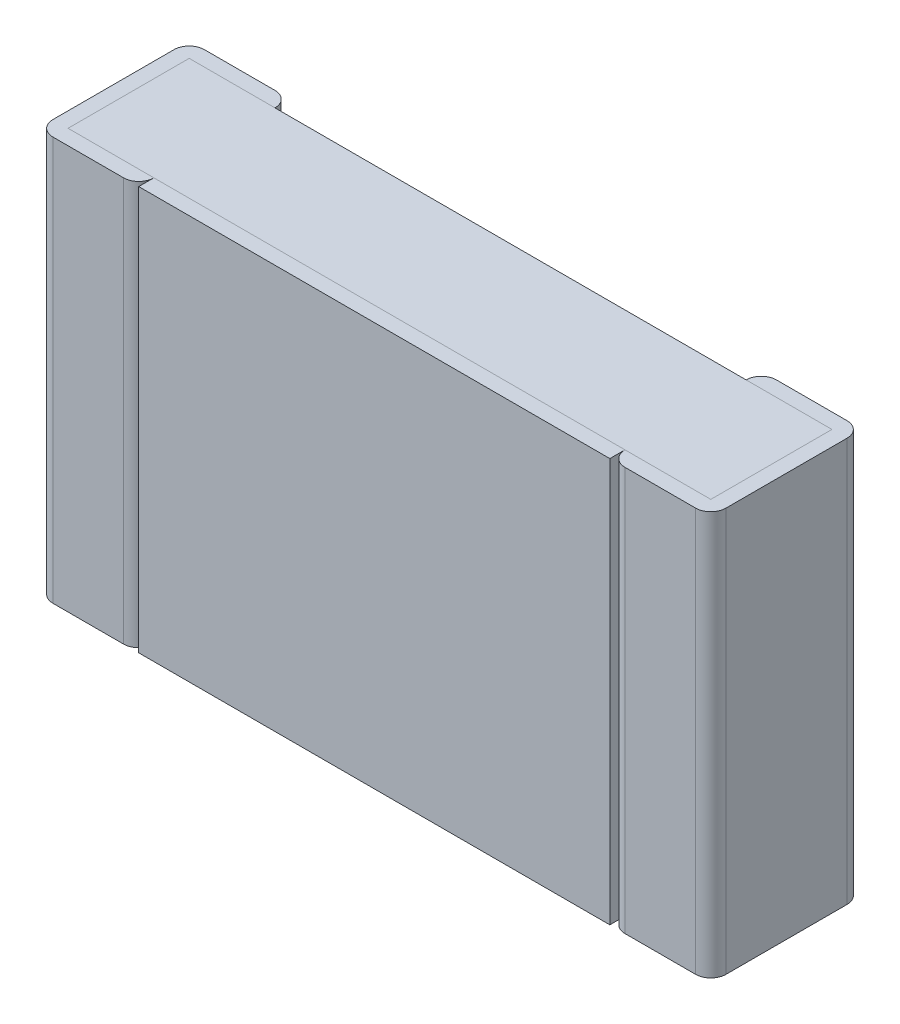
ISO-10303-21;
HEADER;
FILE_DESCRIPTION(('STEP AP214'),'2;1');
FILE_NAME('part.step','',(''),(''),'','','');
FILE_SCHEMA(('AUTOMOTIVE_DESIGN { 1 0 10303 214 1 1 1 1 }'));
ENDSEC;
DATA;
#1=APPLICATION_CONTEXT('core data for automotive mechanical design processes');
#2=APPLICATION_PROTOCOL_DEFINITION('international standard','automotive_design',2000,#1);
#3=PRODUCT_CONTEXT('',#1,'mechanical');
#4=PRODUCT('Part','Part','',(#3));
#5=PRODUCT_RELATED_PRODUCT_CATEGORY('part','',(#4));
#6=PRODUCT_DEFINITION_FORMATION('','',#4);
#7=PRODUCT_DEFINITION_CONTEXT('part definition',#1,'design');
#8=PRODUCT_DEFINITION('design','',#6,#7);
#9=PRODUCT_DEFINITION_SHAPE('','',#8);
#10=(LENGTH_UNIT() NAMED_UNIT(*) SI_UNIT(.MILLI.,.METRE.));
#11=(NAMED_UNIT(*) PLANE_ANGLE_UNIT() SI_UNIT($,.RADIAN.));
#12=(NAMED_UNIT(*) SI_UNIT($,.STERADIAN.) SOLID_ANGLE_UNIT());
#13=UNCERTAINTY_MEASURE_WITH_UNIT(LENGTH_MEASURE(1.E-05),#10,'distance_accuracy_value','');
#14=(GEOMETRIC_REPRESENTATION_CONTEXT(3) GLOBAL_UNCERTAINTY_ASSIGNED_CONTEXT((#13)) GLOBAL_UNIT_ASSIGNED_CONTEXT((#10,
#11,#12)) REPRESENTATION_CONTEXT('',''));
#15=CARTESIAN_POINT('',(0.,0.,0.));
#16=DIRECTION('',(0.,0.,1.));
#17=DIRECTION('',(1.,0.,0.));
#18=AXIS2_PLACEMENT_3D('',#15,#16,#17);
#19=CARTESIAN_POINT('',(-0.7,-0.6,0.45));
#20=DIRECTION('',(0.,0.,1.));
#21=DIRECTION('',(1.,0.,0.));
#22=AXIS2_PLACEMENT_3D('',#19,#20,#21);
#23=PLANE('',#22);
#24=DIRECTION('',(0.,1.,0.));
#25=VECTOR('',#24,1.);
#26=CARTESIAN_POINT('',(-0.7,-0.6,0.45));
#27=LINE('',#26,#25);
#28=CARTESIAN_POINT('',(-0.7,-0.6,0.45));
#29=VERTEX_POINT('',#28);
#30=CARTESIAN_POINT('',(-0.7,0.6,0.45));
#31=VERTEX_POINT('',#30);
#32=EDGE_CURVE('E241',#29,#31,#27,.T.);
#33=ORIENTED_EDGE('',*,*,#32,.F.);
#34=DIRECTION('',(1.,0.,0.));
#35=VECTOR('',#34,1.);
#36=CARTESIAN_POINT('',(-0.7,-0.6,0.45));
#37=LINE('',#36,#35);
#38=CARTESIAN_POINT('',(0.7,-0.6,0.45));
#39=VERTEX_POINT('',#38);
#40=EDGE_CURVE('E291',#29,#39,#37,.T.);
#41=ORIENTED_EDGE('',*,*,#40,.T.);
#42=DIRECTION('',(0.,1.,0.));
#43=VECTOR('',#42,1.);
#44=CARTESIAN_POINT('',(0.7,-0.6,0.45));
#45=LINE('',#44,#43);
#46=CARTESIAN_POINT('',(0.7,0.6,0.45));
#47=VERTEX_POINT('',#46);
#48=EDGE_CURVE('E11',#39,#47,#45,.T.);
#49=ORIENTED_EDGE('',*,*,#48,.T.);
#50=DIRECTION('',(1.,0.,0.));
#51=VECTOR('',#50,1.);
#52=CARTESIAN_POINT('',(-0.7,0.6,0.45));
#53=LINE('',#52,#51);
#54=EDGE_CURVE('E315',#31,#47,#53,.T.);
#55=ORIENTED_EDGE('',*,*,#54,.F.);
#56=EDGE_LOOP('',(#33,#41,#49,#55));
#57=FACE_BOUND('',#56,.T.);
#58=ADVANCED_FACE('F19',(#57),#23,.T.);
#59=CARTESIAN_POINT('',(0.7,-0.6,0.405));
#60=DIRECTION('',(1.,0.,0.));
#61=DIRECTION('',(0.,1.,0.));
#62=AXIS2_PLACEMENT_3D('',#59,#60,#61);
#63=PLANE('',#62);
#64=DIRECTION('',(0.,0.,1.));
#65=VECTOR('',#64,1.);
#66=CARTESIAN_POINT('',(0.7,-0.6,0.405));
#67=LINE('',#66,#65);
#68=CARTESIAN_POINT('',(0.7,-0.6,0.405));
#69=VERTEX_POINT('',#68);
#70=EDGE_CURVE('E294',#69,#39,#67,.T.);
#71=ORIENTED_EDGE('',*,*,#70,.F.);
#72=DIRECTION('',(0.,1.,0.));
#73=VECTOR('',#72,1.);
#74=CARTESIAN_POINT('',(0.7,-0.6,0.405));
#75=LINE('',#74,#73);
#76=CARTESIAN_POINT('',(0.7,0.6,0.405));
#77=VERTEX_POINT('',#76);
#78=EDGE_CURVE('E30',#69,#77,#75,.T.);
#79=ORIENTED_EDGE('',*,*,#78,.T.);
#80=DIRECTION('',(0.,0.,1.));
#81=VECTOR('',#80,1.);
#82=CARTESIAN_POINT('',(0.7,0.6,0.405));
#83=LINE('',#82,#81);
#84=EDGE_CURVE('E370',#77,#47,#83,.T.);
#85=ORIENTED_EDGE('',*,*,#84,.T.);
#86=ORIENTED_EDGE('',*,*,#48,.F.);
#87=EDGE_LOOP('',(#71,#79,#85,#86));
#88=FACE_BOUND('',#87,.T.);
#89=ADVANCED_FACE('F586',(#88),#63,.T.);
#90=CARTESIAN_POINT('',(0.745,-0.6,0.405));
#91=DIRECTION('',(0.,1.,0.));
#92=DIRECTION('',(-1.,0.,0.));
#93=AXIS2_PLACEMENT_3D('',#90,#91,#92);
#94=CYLINDRICAL_SURFACE('',#93,0.045);
#95=CARTESIAN_POINT('',(0.745,-0.6,0.405));
#96=DIRECTION('',(0.,1.,0.));
#97=DIRECTION('',(0.,0.,1.));
#98=AXIS2_PLACEMENT_3D('',#95,#96,#97);
#99=CIRCLE('',#98,0.045);
#100=CARTESIAN_POINT('',(0.745,-0.6,0.45));
#101=VERTEX_POINT('',#100);
#102=EDGE_CURVE('E235',#69,#101,#99,.T.);
#103=ORIENTED_EDGE('',*,*,#102,.T.);
#104=DIRECTION('',(0.,1.,0.));
#105=VECTOR('',#104,1.);
#106=CARTESIAN_POINT('',(0.745,-0.6,0.45));
#107=LINE('',#106,#105);
#108=CARTESIAN_POINT('',(0.745,0.6,0.45));
#109=VERTEX_POINT('',#108);
#110=EDGE_CURVE('E305',#101,#109,#107,.T.);
#111=ORIENTED_EDGE('',*,*,#110,.T.);
#112=CARTESIAN_POINT('',(0.745,0.6,0.405));
#113=DIRECTION('',(0.,1.,0.));
#114=DIRECTION('',(0.,0.,1.));
#115=AXIS2_PLACEMENT_3D('',#112,#113,#114);
#116=CIRCLE('',#115,0.045);
#117=EDGE_CURVE('E252',#77,#109,#116,.T.);
#118=ORIENTED_EDGE('',*,*,#117,.F.);
#119=ORIENTED_EDGE('',*,*,#78,.F.);
#120=EDGE_LOOP('',(#103,#111,#118,#119));
#121=FACE_BOUND('',#120,.T.);
#122=ADVANCED_FACE('F422',(#121),#94,.T.);
#123=CARTESIAN_POINT('',(0.7,-0.6,0.45));
#124=DIRECTION('',(0.,0.,1.));
#125=DIRECTION('',(1.,0.,0.));
#126=AXIS2_PLACEMENT_3D('',#123,#124,#125);
#127=PLANE('',#126);
#128=DIRECTION('',(1.,0.,0.));
#129=VECTOR('',#128,1.);
#130=CARTESIAN_POINT('',(0.7,0.6,0.45));
#131=LINE('',#130,#129);
#132=CARTESIAN_POINT('',(0.955,0.6,0.45));
#133=VERTEX_POINT('',#132);
#134=EDGE_CURVE('E247',#109,#133,#131,.T.);
#135=ORIENTED_EDGE('',*,*,#134,.F.);
#136=ORIENTED_EDGE('',*,*,#110,.F.);
#137=DIRECTION('',(1.,0.,0.));
#138=VECTOR('',#137,1.);
#139=CARTESIAN_POINT('',(0.7,-0.6,0.45));
#140=LINE('',#139,#138);
#141=CARTESIAN_POINT('',(0.955,-0.6,0.45));
#142=VERTEX_POINT('',#141);
#143=EDGE_CURVE('E342',#101,#142,#140,.T.);
#144=ORIENTED_EDGE('',*,*,#143,.T.);
#145=DIRECTION('',(0.,1.,0.));
#146=VECTOR('',#145,1.);
#147=CARTESIAN_POINT('',(0.955,-0.6,0.45));
#148=LINE('',#147,#146);
#149=EDGE_CURVE('E389',#142,#133,#148,.T.);
#150=ORIENTED_EDGE('',*,*,#149,.T.);
#151=EDGE_LOOP('',(#135,#136,#144,#150));
#152=FACE_BOUND('',#151,.T.);
#153=ADVANCED_FACE('F417',(#152),#127,.T.);
#154=CARTESIAN_POINT('',(0.955,-0.6,0.405));
#155=DIRECTION('',(0.,1.,0.));
#156=DIRECTION('',(1.,0.,0.));
#157=AXIS2_PLACEMENT_3D('',#154,#155,#156);
#158=CYLINDRICAL_SURFACE('',#157,0.045);
#159=DIRECTION('',(0.,1.,0.));
#160=VECTOR('',#159,1.);
#161=CARTESIAN_POINT('',(1.,-0.6,0.405));
#162=LINE('',#161,#160);
#163=CARTESIAN_POINT('',(1.,-0.6,0.405));
#164=VERTEX_POINT('',#163);
#165=CARTESIAN_POINT('',(1.,0.6,0.405));
#166=VERTEX_POINT('',#165);
#167=EDGE_CURVE('E289',#164,#166,#162,.T.);
#168=ORIENTED_EDGE('',*,*,#167,.T.);
#169=CARTESIAN_POINT('',(0.955,0.6,0.405));
#170=DIRECTION('',(0.,-1.,0.));
#171=DIRECTION('',(0.,0.,1.));
#172=AXIS2_PLACEMENT_3D('',#169,#170,#171);
#173=CIRCLE('',#172,0.045);
#174=EDGE_CURVE('E251',#166,#133,#173,.T.);
#175=ORIENTED_EDGE('',*,*,#174,.T.);
#176=ORIENTED_EDGE('',*,*,#149,.F.);
#177=CARTESIAN_POINT('',(0.955,-0.6,0.405));
#178=DIRECTION('',(0.,-1.,0.));
#179=DIRECTION('',(0.,0.,1.));
#180=AXIS2_PLACEMENT_3D('',#177,#178,#179);
#181=CIRCLE('',#180,0.045);
#182=EDGE_CURVE('E310',#164,#142,#181,.T.);
#183=ORIENTED_EDGE('',*,*,#182,.F.);
#184=EDGE_LOOP('',(#168,#175,#176,#183));
#185=FACE_BOUND('',#184,.T.);
#186=ADVANCED_FACE('F411',(#185),#158,.T.);
#187=CARTESIAN_POINT('',(1.,-0.6,0.));
#188=DIRECTION('',(1.,0.,0.));
#189=DIRECTION('',(0.,1.,0.));
#190=AXIS2_PLACEMENT_3D('',#187,#188,#189);
#191=PLANE('',#190);
#192=DIRECTION('',(0.,0.,1.));
#193=VECTOR('',#192,1.);
#194=CARTESIAN_POINT('',(1.,-0.6,0.));
#195=LINE('',#194,#193);
#196=CARTESIAN_POINT('',(1.,-0.6,0.045));
#197=VERTEX_POINT('',#196);
#198=EDGE_CURVE('E306',#197,#164,#195,.T.);
#199=ORIENTED_EDGE('',*,*,#198,.F.);
#200=DIRECTION('',(0.,1.,0.));
#201=VECTOR('',#200,1.);
#202=CARTESIAN_POINT('',(1.,-0.6,0.045));
#203=LINE('',#202,#201);
#204=CARTESIAN_POINT('',(1.,0.6,0.045));
#205=VERTEX_POINT('',#204);
#206=EDGE_CURVE('E286',#197,#205,#203,.T.);
#207=ORIENTED_EDGE('',*,*,#206,.T.);
#208=DIRECTION('',(0.,0.,1.));
#209=VECTOR('',#208,1.);
#210=CARTESIAN_POINT('',(1.,0.6,0.));
#211=LINE('',#210,#209);
#212=EDGE_CURVE('E262',#205,#166,#211,.T.);
#213=ORIENTED_EDGE('',*,*,#212,.T.);
#214=ORIENTED_EDGE('',*,*,#167,.F.);
#215=EDGE_LOOP('',(#199,#207,#213,#214));
#216=FACE_BOUND('',#215,.T.);
#217=ADVANCED_FACE('F572',(#216),#191,.T.);
#218=CARTESIAN_POINT('',(0.955,-0.6,0.045));
#219=DIRECTION('',(0.,1.,0.));
#220=DIRECTION('',(1.,0.,0.));
#221=AXIS2_PLACEMENT_3D('',#218,#219,#220);
#222=CYLINDRICAL_SURFACE('',#221,0.045);
#223=CARTESIAN_POINT('',(0.955,-0.6,0.045));
#224=DIRECTION('',(0.,1.,0.));
#225=DIRECTION('',(0.,0.,1.));
#226=AXIS2_PLACEMENT_3D('',#223,#224,#225);
#227=CIRCLE('',#226,0.045);
#228=CARTESIAN_POINT('',(0.955,-0.6,0.));
#229=VERTEX_POINT('',#228);
#230=EDGE_CURVE('E311',#197,#229,#227,.T.);
#231=ORIENTED_EDGE('',*,*,#230,.T.);
#232=DIRECTION('',(0.,1.,0.));
#233=VECTOR('',#232,1.);
#234=CARTESIAN_POINT('',(0.955,-0.6,0.));
#235=LINE('',#234,#233);
#236=CARTESIAN_POINT('',(0.955,0.6,0.));
#237=VERTEX_POINT('',#236);
#238=EDGE_CURVE('E290',#229,#237,#235,.T.);
#239=ORIENTED_EDGE('',*,*,#238,.T.);
#240=CARTESIAN_POINT('',(0.955,0.6,0.045));
#241=DIRECTION('',(0.,1.,0.));
#242=DIRECTION('',(0.,0.,1.));
#243=AXIS2_PLACEMENT_3D('',#240,#241,#242);
#244=CIRCLE('',#243,0.045);
#245=EDGE_CURVE('E301',#205,#237,#244,.T.);
#246=ORIENTED_EDGE('',*,*,#245,.F.);
#247=ORIENTED_EDGE('',*,*,#206,.F.);
#248=EDGE_LOOP('',(#231,#239,#246,#247));
#249=FACE_BOUND('',#248,.T.);
#250=ADVANCED_FACE('F569',(#249),#222,.T.);
#251=CARTESIAN_POINT('',(0.7,-0.6,0.));
#252=DIRECTION('',(0.,0.,1.));
#253=DIRECTION('',(1.,0.,0.));
#254=AXIS2_PLACEMENT_3D('',#251,#252,#253);
#255=PLANE('',#254);
#256=ORIENTED_EDGE('',*,*,#238,.F.);
#257=DIRECTION('',(1.,0.,0.));
#258=VECTOR('',#257,1.);
#259=CARTESIAN_POINT('',(0.7,-0.6,0.));
#260=LINE('',#259,#258);
#261=CARTESIAN_POINT('',(0.745,-0.6,0.));
#262=VERTEX_POINT('',#261);
#263=EDGE_CURVE('E357',#262,#229,#260,.T.);
#264=ORIENTED_EDGE('',*,*,#263,.F.);
#265=DIRECTION('',(0.,1.,0.));
#266=VECTOR('',#265,1.);
#267=CARTESIAN_POINT('',(0.745,-0.6,0.));
#268=LINE('',#267,#266);
#269=CARTESIAN_POINT('',(0.745,0.6,0.));
#270=VERTEX_POINT('',#269);
#271=EDGE_CURVE('E375',#262,#270,#268,.T.);
#272=ORIENTED_EDGE('',*,*,#271,.T.);
#273=DIRECTION('',(1.,0.,0.));
#274=VECTOR('',#273,1.);
#275=CARTESIAN_POINT('',(0.7,0.6,0.));
#276=LINE('',#275,#274);
#277=EDGE_CURVE('E285',#270,#237,#276,.T.);
#278=ORIENTED_EDGE('',*,*,#277,.T.);
#279=EDGE_LOOP('',(#256,#264,#272,#278));
#280=FACE_BOUND('',#279,.T.);
#281=ADVANCED_FACE('F566',(#280),#255,.F.);
#282=CARTESIAN_POINT('',(0.745,-0.6,0.045));
#283=DIRECTION('',(0.,1.,0.));
#284=DIRECTION('',(-1.,0.,0.));
#285=AXIS2_PLACEMENT_3D('',#282,#283,#284);
#286=CYLINDRICAL_SURFACE('',#285,0.045);
#287=DIRECTION('',(0.,1.,0.));
#288=VECTOR('',#287,1.);
#289=CARTESIAN_POINT('',(0.7,-0.6,0.045));
#290=LINE('',#289,#288);
#291=CARTESIAN_POINT('',(0.7,-0.6,0.045));
#292=VERTEX_POINT('',#291);
#293=CARTESIAN_POINT('',(0.7,0.6,0.045));
#294=VERTEX_POINT('',#293);
#295=EDGE_CURVE('E23',#292,#294,#290,.T.);
#296=ORIENTED_EDGE('',*,*,#295,.T.);
#297=CARTESIAN_POINT('',(0.745,0.6,0.045));
#298=DIRECTION('',(0.,-1.,0.));
#299=DIRECTION('',(0.,0.,1.));
#300=AXIS2_PLACEMENT_3D('',#297,#298,#299);
#301=CIRCLE('',#300,0.045);
#302=EDGE_CURVE('E214',#294,#270,#301,.T.);
#303=ORIENTED_EDGE('',*,*,#302,.T.);
#304=ORIENTED_EDGE('',*,*,#271,.F.);
#305=CARTESIAN_POINT('',(0.745,-0.6,0.045));
#306=DIRECTION('',(0.,-1.,0.));
#307=DIRECTION('',(0.,0.,1.));
#308=AXIS2_PLACEMENT_3D('',#305,#306,#307);
#309=CIRCLE('',#308,0.045);
#310=EDGE_CURVE('E353',#292,#262,#309,.T.);
#311=ORIENTED_EDGE('',*,*,#310,.F.);
#312=EDGE_LOOP('',(#296,#303,#304,#311));
#313=FACE_BOUND('',#312,.T.);
#314=ADVANCED_FACE('F597',(#313),#286,.T.);
#315=CARTESIAN_POINT('',(-0.7,0.6,0.405));
#316=DIRECTION('',(0.,1.,0.));
#317=DIRECTION('',(1.,0.,0.));
#318=AXIS2_PLACEMENT_3D('',#315,#316,#317);
#319=PLANE('',#318);
#320=DIRECTION('',(1.,0.,0.));
#321=VECTOR('',#320,1.);
#322=CARTESIAN_POINT('',(-0.7,0.6,0.405));
#323=LINE('',#322,#321);
#324=CARTESIAN_POINT('',(-0.7,0.6,0.405));
#325=VERTEX_POINT('',#324);
#326=EDGE_CURVE('E231',#325,#77,#323,.T.);
#327=ORIENTED_EDGE('',*,*,#326,.F.);
#328=DIRECTION('',(0.,0.,1.));
#329=VECTOR('',#328,1.);
#330=CARTESIAN_POINT('',(-0.7,0.6,0.405));
#331=LINE('',#330,#329);
#332=EDGE_CURVE('E245',#325,#31,#331,.T.);
#333=ORIENTED_EDGE('',*,*,#332,.T.);
#334=ORIENTED_EDGE('',*,*,#54,.T.);
#335=ORIENTED_EDGE('',*,*,#84,.F.);
#336=EDGE_LOOP('',(#327,#333,#334,#335));
#337=FACE_BOUND('',#336,.T.);
#338=ADVANCED_FACE('F549',(#337),#319,.T.);
#339=CARTESIAN_POINT('',(0.7,0.6,0.));
#340=DIRECTION('',(0.,1.,0.));
#341=DIRECTION('',(1.,0.,0.));
#342=AXIS2_PLACEMENT_3D('',#339,#340,#341);
#343=PLANE('',#342);
#344=ORIENTED_EDGE('',*,*,#277,.F.);
#345=ORIENTED_EDGE('',*,*,#302,.F.);
#346=DIRECTION('',(1.,0.,0.));
#347=VECTOR('',#346,1.);
#348=CARTESIAN_POINT('',(-0.955,0.6,0.045));
#349=LINE('',#348,#347);
#350=CARTESIAN_POINT('',(0.955,0.6,0.045));
#351=VERTEX_POINT('',#350);
#352=EDGE_CURVE('E207',#294,#351,#349,.T.);
#353=ORIENTED_EDGE('',*,*,#352,.T.);
#354=DIRECTION('',(0.,0.,1.));
#355=VECTOR('',#354,1.);
#356=CARTESIAN_POINT('',(0.955,0.6,0.045));
#357=LINE('',#356,#355);
#358=CARTESIAN_POINT('',(0.955,0.6,0.405));
#359=VERTEX_POINT('',#358);
#360=EDGE_CURVE('E211',#351,#359,#357,.T.);
#361=ORIENTED_EDGE('',*,*,#360,.T.);
#362=DIRECTION('',(1.,0.,0.));
#363=VECTOR('',#362,1.);
#364=CARTESIAN_POINT('',(-0.955,0.6,0.405));
#365=LINE('',#364,#363);
#366=EDGE_CURVE('E224',#77,#359,#365,.T.);
#367=ORIENTED_EDGE('',*,*,#366,.F.);
#368=ORIENTED_EDGE('',*,*,#117,.T.);
#369=ORIENTED_EDGE('',*,*,#134,.T.);
#370=ORIENTED_EDGE('',*,*,#174,.F.);
#371=ORIENTED_EDGE('',*,*,#212,.F.);
#372=ORIENTED_EDGE('',*,*,#245,.T.);
#373=EDGE_LOOP('',(#344,#345,#353,#361,#367,#368,#369,#370,#371,#372));
#374=FACE_BOUND('',#373,.T.);
#375=ADVANCED_FACE('F21',(#374),#343,.T.);
#376=CARTESIAN_POINT('',(-0.7,-0.6,0.405));
#377=DIRECTION('',(1.,0.,0.));
#378=DIRECTION('',(0.,1.,0.));
#379=AXIS2_PLACEMENT_3D('',#376,#377,#378);
#380=PLANE('',#379);
#381=ORIENTED_EDGE('',*,*,#32,.T.);
#382=ORIENTED_EDGE('',*,*,#332,.F.);
#383=DIRECTION('',(0.,1.,0.));
#384=VECTOR('',#383,1.);
#385=CARTESIAN_POINT('',(-0.7,-0.6,0.405));
#386=LINE('',#385,#384);
#387=CARTESIAN_POINT('',(-0.7,-0.6,0.405));
#388=VERTEX_POINT('',#387);
#389=EDGE_CURVE('E239',#388,#325,#386,.T.);
#390=ORIENTED_EDGE('',*,*,#389,.F.);
#391=DIRECTION('',(0.,0.,1.));
#392=VECTOR('',#391,1.);
#393=CARTESIAN_POINT('',(-0.7,-0.6,0.405));
#394=LINE('',#393,#392);
#395=EDGE_CURVE('E246',#388,#29,#394,.T.);
#396=ORIENTED_EDGE('',*,*,#395,.T.);
#397=EDGE_LOOP('',(#381,#382,#390,#396));
#398=FACE_BOUND('',#397,.T.);
#399=ADVANCED_FACE('F545',(#398),#380,.F.);
#400=CARTESIAN_POINT('',(-0.7,-0.6,0.405));
#401=DIRECTION('',(0.,1.,0.));
#402=DIRECTION('',(1.,0.,0.));
#403=AXIS2_PLACEMENT_3D('',#400,#401,#402);
#404=PLANE('',#403);
#405=ORIENTED_EDGE('',*,*,#70,.T.);
#406=ORIENTED_EDGE('',*,*,#40,.F.);
#407=ORIENTED_EDGE('',*,*,#395,.F.);
#408=DIRECTION('',(1.,0.,0.));
#409=VECTOR('',#408,1.);
#410=CARTESIAN_POINT('',(-0.7,-0.6,0.405));
#411=LINE('',#410,#409);
#412=EDGE_CURVE('E240',#388,#69,#411,.T.);
#413=ORIENTED_EDGE('',*,*,#412,.T.);
#414=EDGE_LOOP('',(#405,#406,#407,#413));
#415=FACE_BOUND('',#414,.T.);
#416=ADVANCED_FACE('F542',(#415),#404,.F.);
#417=CARTESIAN_POINT('',(0.7,-0.6,0.));
#418=DIRECTION('',(0.,1.,0.));
#419=DIRECTION('',(1.,0.,0.));
#420=AXIS2_PLACEMENT_3D('',#417,#418,#419);
#421=PLANE('',#420);
#422=ORIENTED_EDGE('',*,*,#230,.F.);
#423=ORIENTED_EDGE('',*,*,#198,.T.);
#424=ORIENTED_EDGE('',*,*,#182,.T.);
#425=ORIENTED_EDGE('',*,*,#143,.F.);
#426=ORIENTED_EDGE('',*,*,#102,.F.);
#427=DIRECTION('',(1.,0.,0.));
#428=VECTOR('',#427,1.);
#429=CARTESIAN_POINT('',(-0.955,-0.6,0.405));
#430=LINE('',#429,#428);
#431=CARTESIAN_POINT('',(0.955,-0.6,0.405));
#432=VERTEX_POINT('',#431);
#433=EDGE_CURVE('E263',#69,#432,#430,.T.);
#434=ORIENTED_EDGE('',*,*,#433,.T.);
#435=DIRECTION('',(0.,0.,1.));
#436=VECTOR('',#435,1.);
#437=CARTESIAN_POINT('',(0.955,-0.6,0.045));
#438=LINE('',#437,#436);
#439=CARTESIAN_POINT('',(0.955,-0.6,0.045));
#440=VERTEX_POINT('',#439);
#441=EDGE_CURVE('E266',#440,#432,#438,.T.);
#442=ORIENTED_EDGE('',*,*,#441,.F.);
#443=DIRECTION('',(1.,0.,0.));
#444=VECTOR('',#443,1.);
#445=CARTESIAN_POINT('',(-0.955,-0.6,0.045));
#446=LINE('',#445,#444);
#447=EDGE_CURVE('E282',#292,#440,#446,.T.);
#448=ORIENTED_EDGE('',*,*,#447,.F.);
#449=ORIENTED_EDGE('',*,*,#310,.T.);
#450=ORIENTED_EDGE('',*,*,#263,.T.);
#451=EDGE_LOOP('',(#422,#423,#424,#425,#426,#434,#442,#448,#449,#450));
#452=FACE_BOUND('',#451,.T.);
#453=ADVANCED_FACE('F407',(#452),#421,.F.);
#454=CARTESIAN_POINT('',(-0.955,-0.6,0.045));
#455=DIRECTION('',(0.,0.,1.));
#456=DIRECTION('',(1.,0.,0.));
#457=AXIS2_PLACEMENT_3D('',#454,#455,#456);
#458=PLANE('',#457);
#459=DIRECTION('',(1.,0.,0.));
#460=VECTOR('',#459,1.);
#461=CARTESIAN_POINT('',(-0.955,0.6,0.045));
#462=LINE('',#461,#460);
#463=CARTESIAN_POINT('',(-0.7,0.6,0.045));
#464=VERTEX_POINT('',#463);
#465=EDGE_CURVE('E219',#464,#294,#462,.T.);
#466=ORIENTED_EDGE('',*,*,#465,.T.);
#467=ORIENTED_EDGE('',*,*,#295,.F.);
#468=DIRECTION('',(1.,0.,0.));
#469=VECTOR('',#468,1.);
#470=CARTESIAN_POINT('',(-0.955,-0.6,0.045));
#471=LINE('',#470,#469);
#472=CARTESIAN_POINT('',(-0.7,-0.6,0.045));
#473=VERTEX_POINT('',#472);
#474=EDGE_CURVE('E323',#473,#292,#471,.T.);
#475=ORIENTED_EDGE('',*,*,#474,.F.);
#476=DIRECTION('',(0.,1.,0.));
#477=VECTOR('',#476,1.);
#478=CARTESIAN_POINT('',(-0.7,-0.6,0.045));
#479=LINE('',#478,#477);
#480=EDGE_CURVE('E327',#473,#464,#479,.T.);
#481=ORIENTED_EDGE('',*,*,#480,.T.);
#482=EDGE_LOOP('',(#466,#467,#475,#481));
#483=FACE_BOUND('',#482,.T.);
#484=ADVANCED_FACE('F537',(#483),#458,.F.);
#485=CARTESIAN_POINT('',(-0.955,0.6,0.045));
#486=DIRECTION('',(0.,1.,0.));
#487=DIRECTION('',(1.,0.,0.));
#488=AXIS2_PLACEMENT_3D('',#485,#486,#487);
#489=PLANE('',#488);
#490=DIRECTION('',(1.,0.,0.));
#491=VECTOR('',#490,1.);
#492=CARTESIAN_POINT('',(-0.955,0.6,0.045));
#493=LINE('',#492,#491);
#494=CARTESIAN_POINT('',(-0.955,0.6,0.045));
#495=VERTEX_POINT('',#494);
#496=EDGE_CURVE('E349',#495,#464,#493,.T.);
#497=ORIENTED_EDGE('',*,*,#496,.F.);
#498=DIRECTION('',(0.,0.,1.));
#499=VECTOR('',#498,1.);
#500=CARTESIAN_POINT('',(-0.955,0.6,0.045));
#501=LINE('',#500,#499);
#502=CARTESIAN_POINT('',(-0.955,0.6,0.405));
#503=VERTEX_POINT('',#502);
#504=EDGE_CURVE('E346',#495,#503,#501,.T.);
#505=ORIENTED_EDGE('',*,*,#504,.T.);
#506=DIRECTION('',(1.,0.,0.));
#507=VECTOR('',#506,1.);
#508=CARTESIAN_POINT('',(-0.955,0.6,0.405));
#509=LINE('',#508,#507);
#510=EDGE_CURVE('E257',#503,#325,#509,.T.);
#511=ORIENTED_EDGE('',*,*,#510,.T.);
#512=ORIENTED_EDGE('',*,*,#326,.T.);
#513=ORIENTED_EDGE('',*,*,#366,.T.);
#514=ORIENTED_EDGE('',*,*,#360,.F.);
#515=ORIENTED_EDGE('',*,*,#352,.F.);
#516=ORIENTED_EDGE('',*,*,#465,.F.);
#517=EDGE_LOOP('',(#497,#505,#511,#512,#513,#514,#515,#516));
#518=FACE_BOUND('',#517,.T.);
#519=ADVANCED_FACE('F222',(#518),#489,.T.);
#520=CARTESIAN_POINT('',(-0.745,-0.6,0.405));
#521=DIRECTION('',(0.,1.,0.));
#522=DIRECTION('',(1.,0.,0.));
#523=AXIS2_PLACEMENT_3D('',#520,#521,#522);
#524=CYLINDRICAL_SURFACE('',#523,0.045);
#525=ORIENTED_EDGE('',*,*,#389,.T.);
#526=CARTESIAN_POINT('',(-0.745,0.6,0.405));
#527=DIRECTION('',(0.,-1.,0.));
#528=DIRECTION('',(0.,0.,1.));
#529=AXIS2_PLACEMENT_3D('',#526,#527,#528);
#530=CIRCLE('',#529,0.045);
#531=CARTESIAN_POINT('',(-0.745,0.6,0.45));
#532=VERTEX_POINT('',#531);
#533=EDGE_CURVE('E253',#325,#532,#530,.T.);
#534=ORIENTED_EDGE('',*,*,#533,.T.);
#535=DIRECTION('',(0.,1.,0.));
#536=VECTOR('',#535,1.);
#537=CARTESIAN_POINT('',(-0.745,-0.6,0.45));
#538=LINE('',#537,#536);
#539=CARTESIAN_POINT('',(-0.745,-0.6,0.45));
#540=VERTEX_POINT('',#539);
#541=EDGE_CURVE('E237',#540,#532,#538,.T.);
#542=ORIENTED_EDGE('',*,*,#541,.F.);
#543=CARTESIAN_POINT('',(-0.745,-0.6,0.405));
#544=DIRECTION('',(0.,-1.,0.));
#545=DIRECTION('',(0.,0.,1.));
#546=AXIS2_PLACEMENT_3D('',#543,#544,#545);
#547=CIRCLE('',#546,0.045);
#548=EDGE_CURVE('E395',#388,#540,#547,.T.);
#549=ORIENTED_EDGE('',*,*,#548,.F.);
#550=EDGE_LOOP('',(#525,#534,#542,#549));
#551=FACE_BOUND('',#550,.T.);
#552=ADVANCED_FACE('F512',(#551),#524,.T.);
#553=CARTESIAN_POINT('',(-1.,-0.6,0.45));
#554=DIRECTION('',(0.,0.,1.));
#555=DIRECTION('',(1.,0.,0.));
#556=AXIS2_PLACEMENT_3D('',#553,#554,#555);
#557=PLANE('',#556);
#558=DIRECTION('',(1.,0.,0.));
#559=VECTOR('',#558,1.);
#560=CARTESIAN_POINT('',(-1.,0.6,0.45));
#561=LINE('',#560,#559);
#562=CARTESIAN_POINT('',(-0.955,0.6,0.45));
#563=VERTEX_POINT('',#562);
#564=EDGE_CURVE('E258',#563,#532,#561,.T.);
#565=ORIENTED_EDGE('',*,*,#564,.F.);
#566=DIRECTION('',(0.,1.,0.));
#567=VECTOR('',#566,1.);
#568=CARTESIAN_POINT('',(-0.955,-0.6,0.45));
#569=LINE('',#568,#567);
#570=CARTESIAN_POINT('',(-0.955,-0.6,0.45));
#571=VERTEX_POINT('',#570);
#572=EDGE_CURVE('E332',#571,#563,#569,.T.);
#573=ORIENTED_EDGE('',*,*,#572,.F.);
#574=DIRECTION('',(1.,0.,0.));
#575=VECTOR('',#574,1.);
#576=CARTESIAN_POINT('',(-1.,-0.6,0.45));
#577=LINE('',#576,#575);
#578=EDGE_CURVE('E278',#571,#540,#577,.T.);
#579=ORIENTED_EDGE('',*,*,#578,.T.);
#580=ORIENTED_EDGE('',*,*,#541,.T.);
#581=EDGE_LOOP('',(#565,#573,#579,#580));
#582=FACE_BOUND('',#581,.T.);
#583=ADVANCED_FACE('F505',(#582),#557,.T.);
#584=CARTESIAN_POINT('',(-0.955,-0.6,0.045));
#585=DIRECTION('',(0.,1.,0.));
#586=DIRECTION('',(1.,0.,0.));
#587=AXIS2_PLACEMENT_3D('',#584,#585,#586);
#588=PLANE('',#587);
#589=ORIENTED_EDGE('',*,*,#474,.T.);
#590=ORIENTED_EDGE('',*,*,#447,.T.);
#591=ORIENTED_EDGE('',*,*,#441,.T.);
#592=ORIENTED_EDGE('',*,*,#433,.F.);
#593=ORIENTED_EDGE('',*,*,#412,.F.);
#594=DIRECTION('',(1.,0.,0.));
#595=VECTOR('',#594,1.);
#596=CARTESIAN_POINT('',(-0.955,-0.6,0.405));
#597=LINE('',#596,#595);
#598=CARTESIAN_POINT('',(-0.955,-0.6,0.405));
#599=VERTEX_POINT('',#598);
#600=EDGE_CURVE('E398',#599,#388,#597,.T.);
#601=ORIENTED_EDGE('',*,*,#600,.F.);
#602=DIRECTION('',(0.,0.,1.));
#603=VECTOR('',#602,1.);
#604=CARTESIAN_POINT('',(-0.955,-0.6,0.045));
#605=LINE('',#604,#603);
#606=CARTESIAN_POINT('',(-0.955,-0.6,0.045));
#607=VERTEX_POINT('',#606);
#608=EDGE_CURVE('E191',#607,#599,#605,.T.);
#609=ORIENTED_EDGE('',*,*,#608,.F.);
#610=DIRECTION('',(1.,0.,0.));
#611=VECTOR('',#610,1.);
#612=CARTESIAN_POINT('',(-0.955,-0.6,0.045));
#613=LINE('',#612,#611);
#614=EDGE_CURVE('E316',#607,#473,#613,.T.);
#615=ORIENTED_EDGE('',*,*,#614,.T.);
#616=EDGE_LOOP('',(#589,#590,#591,#592,#593,#601,#609,#615));
#617=FACE_BOUND('',#616,.T.);
#618=ADVANCED_FACE('F534',(#617),#588,.F.);
#619=CARTESIAN_POINT('',(-0.745,-0.6,0.045));
#620=DIRECTION('',(0.,1.,0.));
#621=DIRECTION('',(1.,0.,0.));
#622=AXIS2_PLACEMENT_3D('',#619,#620,#621);
#623=CYLINDRICAL_SURFACE('',#622,0.045);
#624=CARTESIAN_POINT('',(-0.745,-0.6,0.045));
#625=DIRECTION('',(0.,1.,0.));
#626=DIRECTION('',(0.,0.,1.));
#627=AXIS2_PLACEMENT_3D('',#624,#625,#626);
#628=CIRCLE('',#627,0.045);
#629=CARTESIAN_POINT('',(-0.745,-0.6,0.));
#630=VERTEX_POINT('',#629);
#631=EDGE_CURVE('E271',#473,#630,#628,.T.);
#632=ORIENTED_EDGE('',*,*,#631,.T.);
#633=DIRECTION('',(0.,1.,0.));
#634=VECTOR('',#633,1.);
#635=CARTESIAN_POINT('',(-0.745,-0.6,0.));
#636=LINE('',#635,#634);
#637=CARTESIAN_POINT('',(-0.745,0.6,0.));
#638=VERTEX_POINT('',#637);
#639=EDGE_CURVE('E180',#630,#638,#636,.T.);
#640=ORIENTED_EDGE('',*,*,#639,.T.);
#641=CARTESIAN_POINT('',(-0.745,0.6,0.045));
#642=DIRECTION('',(0.,1.,0.));
#643=DIRECTION('',(0.,0.,1.));
#644=AXIS2_PLACEMENT_3D('',#641,#642,#643);
#645=CIRCLE('',#644,0.045);
#646=EDGE_CURVE('E380',#464,#638,#645,.T.);
#647=ORIENTED_EDGE('',*,*,#646,.F.);
#648=ORIENTED_EDGE('',*,*,#480,.F.);
#649=EDGE_LOOP('',(#632,#640,#647,#648));
#650=FACE_BOUND('',#649,.T.);
#651=ADVANCED_FACE('F531',(#650),#623,.T.);
#652=CARTESIAN_POINT('',(-1.,-0.6,0.));
#653=DIRECTION('',(0.,0.,1.));
#654=DIRECTION('',(1.,0.,0.));
#655=AXIS2_PLACEMENT_3D('',#652,#653,#654);
#656=PLANE('',#655);
#657=ORIENTED_EDGE('',*,*,#639,.F.);
#658=DIRECTION('',(1.,0.,0.));
#659=VECTOR('',#658,1.);
#660=CARTESIAN_POINT('',(-1.,-0.6,0.));
#661=LINE('',#660,#659);
#662=CARTESIAN_POINT('',(-0.955,-0.6,0.));
#663=VERTEX_POINT('',#662);
#664=EDGE_CURVE('E350',#663,#630,#661,.T.);
#665=ORIENTED_EDGE('',*,*,#664,.F.);
#666=DIRECTION('',(0.,1.,0.));
#667=VECTOR('',#666,1.);
#668=CARTESIAN_POINT('',(-0.955,-0.6,0.));
#669=LINE('',#668,#667);
#670=CARTESIAN_POINT('',(-0.955,0.6,0.));
#671=VERTEX_POINT('',#670);
#672=EDGE_CURVE('E337',#663,#671,#669,.T.);
#673=ORIENTED_EDGE('',*,*,#672,.T.);
#674=DIRECTION('',(1.,0.,0.));
#675=VECTOR('',#674,1.);
#676=CARTESIAN_POINT('',(-1.,0.6,0.));
#677=LINE('',#676,#675);
#678=EDGE_CURVE('E443',#671,#638,#677,.T.);
#679=ORIENTED_EDGE('',*,*,#678,.T.);
#680=EDGE_LOOP('',(#657,#665,#673,#679));
#681=FACE_BOUND('',#680,.T.);
#682=ADVANCED_FACE('F601',(#681),#656,.F.);
#683=CARTESIAN_POINT('',(-1.,0.6,0.));
#684=DIRECTION('',(0.,1.,0.));
#685=DIRECTION('',(1.,0.,0.));
#686=AXIS2_PLACEMENT_3D('',#683,#684,#685);
#687=PLANE('',#686);
#688=ORIENTED_EDGE('',*,*,#678,.F.);
#689=CARTESIAN_POINT('',(-0.955,0.6,0.045));
#690=DIRECTION('',(0.,-1.,0.));
#691=DIRECTION('',(0.,0.,1.));
#692=AXIS2_PLACEMENT_3D('',#689,#690,#691);
#693=CIRCLE('',#692,0.045);
#694=CARTESIAN_POINT('',(-1.,0.6,0.045));
#695=VERTEX_POINT('',#694);
#696=EDGE_CURVE('E341',#695,#671,#693,.T.);
#697=ORIENTED_EDGE('',*,*,#696,.F.);
#698=DIRECTION('',(0.,0.,1.));
#699=VECTOR('',#698,1.);
#700=CARTESIAN_POINT('',(-1.,0.6,0.));
#701=LINE('',#700,#699);
#702=CARTESIAN_POINT('',(-1.,0.6,0.405));
#703=VERTEX_POINT('',#702);
#704=EDGE_CURVE('E322',#695,#703,#701,.T.);
#705=ORIENTED_EDGE('',*,*,#704,.T.);
#706=CARTESIAN_POINT('',(-0.955,0.6,0.405));
#707=DIRECTION('',(0.,1.,0.));
#708=DIRECTION('',(0.,0.,1.));
#709=AXIS2_PLACEMENT_3D('',#706,#707,#708);
#710=CIRCLE('',#709,0.045);
#711=EDGE_CURVE('E336',#703,#563,#710,.T.);
#712=ORIENTED_EDGE('',*,*,#711,.T.);
#713=ORIENTED_EDGE('',*,*,#564,.T.);
#714=ORIENTED_EDGE('',*,*,#533,.F.);
#715=ORIENTED_EDGE('',*,*,#510,.F.);
#716=ORIENTED_EDGE('',*,*,#504,.F.);
#717=ORIENTED_EDGE('',*,*,#496,.T.);
#718=ORIENTED_EDGE('',*,*,#646,.T.);
#719=EDGE_LOOP('',(#688,#697,#705,#712,#713,#714,#715,#716,#717,#718));
#720=FACE_BOUND('',#719,.T.);
#721=ADVANCED_FACE('F517',(#720),#687,.T.);
#722=CARTESIAN_POINT('',(-0.955,-0.6,0.405));
#723=DIRECTION('',(0.,1.,0.));
#724=DIRECTION('',(-1.,0.,0.));
#725=AXIS2_PLACEMENT_3D('',#722,#723,#724);
#726=CYLINDRICAL_SURFACE('',#725,0.045);
#727=CARTESIAN_POINT('',(-0.955,-0.6,0.405));
#728=DIRECTION('',(0.,1.,0.));
#729=DIRECTION('',(0.,0.,1.));
#730=AXIS2_PLACEMENT_3D('',#727,#728,#729);
#731=CIRCLE('',#730,0.045);
#732=CARTESIAN_POINT('',(-1.,-0.6,0.405));
#733=VERTEX_POINT('',#732);
#734=EDGE_CURVE('E273',#733,#571,#731,.T.);
#735=ORIENTED_EDGE('',*,*,#734,.T.);
#736=ORIENTED_EDGE('',*,*,#572,.T.);
#737=ORIENTED_EDGE('',*,*,#711,.F.);
#738=DIRECTION('',(0.,1.,0.));
#739=VECTOR('',#738,1.);
#740=CARTESIAN_POINT('',(-1.,-0.6,0.405));
#741=LINE('',#740,#739);
#742=EDGE_CURVE('E331',#733,#703,#741,.T.);
#743=ORIENTED_EDGE('',*,*,#742,.F.);
#744=EDGE_LOOP('',(#735,#736,#737,#743));
#745=FACE_BOUND('',#744,.T.);
#746=ADVANCED_FACE('F522',(#745),#726,.T.);
#747=CARTESIAN_POINT('',(-0.955,-0.6,0.045));
#748=DIRECTION('',(0.,1.,0.));
#749=DIRECTION('',(-1.,0.,0.));
#750=AXIS2_PLACEMENT_3D('',#747,#748,#749);
#751=CYLINDRICAL_SURFACE('',#750,0.045);
#752=DIRECTION('',(0.,1.,0.));
#753=VECTOR('',#752,1.);
#754=CARTESIAN_POINT('',(-1.,-0.6,0.045));
#755=LINE('',#754,#753);
#756=CARTESIAN_POINT('',(-1.,-0.6,0.045));
#757=VERTEX_POINT('',#756);
#758=EDGE_CURVE('E272',#757,#695,#755,.T.);
#759=ORIENTED_EDGE('',*,*,#758,.T.);
#760=ORIENTED_EDGE('',*,*,#696,.T.);
#761=ORIENTED_EDGE('',*,*,#672,.F.);
#762=CARTESIAN_POINT('',(-0.955,-0.6,0.045));
#763=DIRECTION('',(0.,-1.,0.));
#764=DIRECTION('',(0.,0.,1.));
#765=AXIS2_PLACEMENT_3D('',#762,#763,#764);
#766=CIRCLE('',#765,0.045);
#767=EDGE_CURVE('E277',#757,#663,#766,.T.);
#768=ORIENTED_EDGE('',*,*,#767,.F.);
#769=EDGE_LOOP('',(#759,#760,#761,#768));
#770=FACE_BOUND('',#769,.T.);
#771=ADVANCED_FACE('F528',(#770),#751,.T.);
#772=CARTESIAN_POINT('',(-1.,-0.6,0.));
#773=DIRECTION('',(0.,1.,0.));
#774=DIRECTION('',(1.,0.,0.));
#775=AXIS2_PLACEMENT_3D('',#772,#773,#774);
#776=PLANE('',#775);
#777=ORIENTED_EDGE('',*,*,#631,.F.);
#778=ORIENTED_EDGE('',*,*,#614,.F.);
#779=ORIENTED_EDGE('',*,*,#608,.T.);
#780=ORIENTED_EDGE('',*,*,#600,.T.);
#781=ORIENTED_EDGE('',*,*,#548,.T.);
#782=ORIENTED_EDGE('',*,*,#578,.F.);
#783=ORIENTED_EDGE('',*,*,#734,.F.);
#784=DIRECTION('',(0.,0.,1.));
#785=VECTOR('',#784,1.);
#786=CARTESIAN_POINT('',(-1.,-0.6,0.));
#787=LINE('',#786,#785);
#788=EDGE_CURVE('E267',#757,#733,#787,.T.);
#789=ORIENTED_EDGE('',*,*,#788,.F.);
#790=ORIENTED_EDGE('',*,*,#767,.T.);
#791=ORIENTED_EDGE('',*,*,#664,.T.);
#792=EDGE_LOOP('',(#777,#778,#779,#780,#781,#782,#783,#789,#790,#791));
#793=FACE_BOUND('',#792,.T.);
#794=ADVANCED_FACE('F510',(#793),#776,.F.);
#795=CARTESIAN_POINT('',(-1.,-0.6,0.));
#796=DIRECTION('',(1.,0.,0.));
#797=DIRECTION('',(0.,1.,0.));
#798=AXIS2_PLACEMENT_3D('',#795,#796,#797);
#799=PLANE('',#798);
#800=ORIENTED_EDGE('',*,*,#742,.T.);
#801=ORIENTED_EDGE('',*,*,#704,.F.);
#802=ORIENTED_EDGE('',*,*,#758,.F.);
#803=ORIENTED_EDGE('',*,*,#788,.T.);
#804=EDGE_LOOP('',(#800,#801,#802,#803));
#805=FACE_BOUND('',#804,.T.);
#806=ADVANCED_FACE('F526',(#805),#799,.F.);
#807=CLOSED_SHELL('',(#58,#89,#122,#153,#186,#217,#250,#281,#314,#338,#375,#399,#416,#453,#484,
#519,#552,#583,#618,#651,#682,#721,#746,#771,#794,#806));
#808=MANIFOLD_SOLID_BREP('B1',#807);
#809=ADVANCED_BREP_SHAPE_REPRESENTATION('',(#18,#808),#14);
#810=SHAPE_DEFINITION_REPRESENTATION(#9,#809);
ENDSEC;
END-ISO-10303-21;
